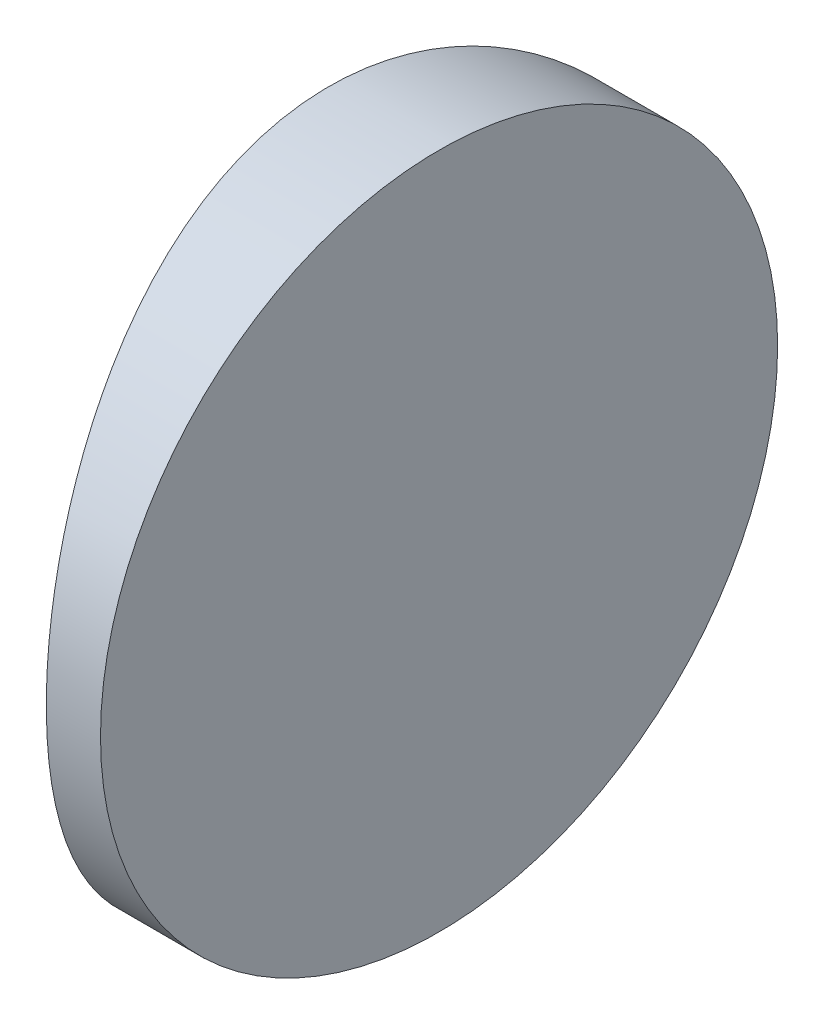
ISO-10303-21;
HEADER;
FILE_DESCRIPTION(('STEP AP214'),'2;1');
FILE_NAME('part.step','',(''),(''),'','','');
FILE_SCHEMA(('AUTOMOTIVE_DESIGN { 1 0 10303 214 1 1 1 1 }'));
ENDSEC;
DATA;
#1=APPLICATION_CONTEXT('core data for automotive mechanical design processes');
#2=APPLICATION_PROTOCOL_DEFINITION('international standard','automotive_design',2000,#1);
#3=PRODUCT_CONTEXT('',#1,'mechanical');
#4=PRODUCT('Part','Part','',(#3));
#5=PRODUCT_RELATED_PRODUCT_CATEGORY('part','',(#4));
#6=PRODUCT_DEFINITION_FORMATION('','',#4);
#7=PRODUCT_DEFINITION_CONTEXT('part definition',#1,'design');
#8=PRODUCT_DEFINITION('design','',#6,#7);
#9=PRODUCT_DEFINITION_SHAPE('','',#8);
#10=(LENGTH_UNIT() NAMED_UNIT(*) SI_UNIT(.MILLI.,.METRE.));
#11=(NAMED_UNIT(*) PLANE_ANGLE_UNIT() SI_UNIT($,.RADIAN.));
#12=(NAMED_UNIT(*) SI_UNIT($,.STERADIAN.) SOLID_ANGLE_UNIT());
#13=UNCERTAINTY_MEASURE_WITH_UNIT(LENGTH_MEASURE(1.E-05),#10,'distance_accuracy_value','');
#14=(GEOMETRIC_REPRESENTATION_CONTEXT(3) GLOBAL_UNCERTAINTY_ASSIGNED_CONTEXT((#13)) GLOBAL_UNIT_ASSIGNED_CONTEXT((#10,
#11,#12)) REPRESENTATION_CONTEXT('',''));
#15=CARTESIAN_POINT('',(0.,0.,0.));
#16=DIRECTION('',(0.,0.,1.));
#17=DIRECTION('',(1.,0.,0.));
#18=AXIS2_PLACEMENT_3D('',#15,#16,#17);
#19=CARTESIAN_POINT('',(4.35520433485127,25.,0.));
#20=DIRECTION('',(0.,-1.,0.));
#21=DIRECTION('',(0.,0.,-1.));
#22=AXIS2_PLACEMENT_3D('',#19,#20,#21);
#23=CYLINDRICAL_SURFACE('',#22,38.78);
#24=CARTESIAN_POINT('',(-34.4247956651487,0.,0.));
#25=CARTESIAN_POINT('',(-34.4248006243454,-6.96973027213713E-06,-0.341550953013682));
#26=CARTESIAN_POINT('',(-34.4202755844788,0.0140042663220976,-0.683020259382038));
#27=CARTESIAN_POINT('',(-34.4023100308665,0.0699044907652003,-1.36353713113696));
#28=CARTESIAN_POINT('',(-34.3888678677692,0.111798636509989,-1.70258423677357));
#29=CARTESIAN_POINT('',(-34.3534143550768,0.223130385841624,-2.37592943781657));
#30=CARTESIAN_POINT('',(-34.3313962516047,0.292589698855622,-2.71022357447478));
#31=CARTESIAN_POINT('',(-34.2793904765031,0.458417378829021,-3.37141619240535));
#32=CARTESIAN_POINT('',(-34.2494031363117,0.55478462670387,-3.69831498063466));
#33=CARTESIAN_POINT('',(-34.1823222768421,0.773391385006729,-4.34188087877066));
#34=CARTESIAN_POINT('',(-34.1452424086419,0.895581240950402,-4.65856629990092));
#35=CARTESIAN_POINT('',(-34.0649085252073,1.16495735031037,-5.28030236192717));
#36=CARTESIAN_POINT('',(-34.0216544558387,1.31214382289512,-5.58535290078066));
#37=CARTESIAN_POINT('',(-33.9300939776697,1.63036920075595,-6.18185867600442));
#38=CARTESIAN_POINT('',(-33.8817886750151,1.80140288656753,-6.47331686876776));
#39=CARTESIAN_POINT('',(-33.7813230452146,2.16621691652042,-7.04108224012345));
#40=CARTESIAN_POINT('',(-33.7291612355484,2.36000602532954,-7.3173835202391));
#41=CARTESIAN_POINT('',(-33.6207594846892,2.77494579582655,-7.86088898215571));
#42=CARTESIAN_POINT('',(-33.5644451566371,2.99672679945906,-8.12759723804377));
#43=CARTESIAN_POINT('',(-33.450610113212,3.46163657215415,-8.64165173650942));
#44=CARTESIAN_POINT('',(-33.3930888580666,3.70477505475633,-8.88898907130167));
#45=CARTESIAN_POINT('',(-33.2783816259764,4.21090158497327,-9.36274770477179));
#46=CARTESIAN_POINT('',(-33.2211957898369,4.47389740401412,-9.58916073654863));
#47=CARTESIAN_POINT('',(-33.1087642730309,5.01793250592284,-10.0194256602124));
#48=CARTESIAN_POINT('',(-33.0535177398293,5.29896370262685,-10.223287552773));
#49=CARTESIAN_POINT('',(-32.945005240198,5.88543180010284,-10.6124788758062));
#50=CARTESIAN_POINT('',(-32.8918353839636,6.19132708587796,-10.7971452966037));
#51=CARTESIAN_POINT('',(-32.7907746690252,6.8183587112528,-11.1398637368011));
#52=CARTESIAN_POINT('',(-32.7428817449185,7.1394890169221,-11.2979261819263));
#53=CARTESIAN_POINT('',(-32.6538958873889,7.79465474570324,-11.5860974668829));
#54=CARTESIAN_POINT('',(-32.6127971532625,8.12867885667799,-11.716230181011));
#55=CARTESIAN_POINT('',(-32.538699552233,8.80736023101136,-11.9475086271894));
#56=CARTESIAN_POINT('',(-32.5056986021252,9.15201473389929,-12.0486618155246));
#57=CARTESIAN_POINT('',(-32.4374931523346,9.98978889958507,-12.2557051107878));
#58=CARTESIAN_POINT('',(-32.4067308102467,10.4869209737582,-12.3471687576587));
#59=CARTESIAN_POINT('',(-32.3654847177115,11.4894290791569,-12.4693084502081));
#60=CARTESIAN_POINT('',(-32.3549993142723,11.9948044349964,-12.4999894509406));
#61=CARTESIAN_POINT('',(-32.3549844401088,12.8410331984954,-12.500007121162));
#62=CARTESIAN_POINT('',(-32.3597525451357,13.181984467207,-12.4860378710293));
#63=CARTESIAN_POINT('',(-32.3786592446169,13.8614505861886,-12.430309637383));
#64=CARTESIAN_POINT('',(-32.3927995909733,14.1999649689839,-12.388545458308));
#65=CARTESIAN_POINT('',(-32.4300242235516,14.8722186883792,-12.277571390077));
#66=CARTESIAN_POINT('',(-32.4531154651062,15.2059541018239,-12.2083401565393));
#67=CARTESIAN_POINT('',(-32.5075200020678,15.8660426190265,-12.0430692008971));
#68=CARTESIAN_POINT('',(-32.5388336327364,16.1923954211749,-11.9470283856431));
#69=CARTESIAN_POINT('',(-32.6086564645724,16.8347840748639,-11.7292126558898));
#70=CARTESIAN_POINT('',(-32.6471497023733,17.1508410218064,-11.607494755451));
#71=CARTESIAN_POINT('',(-32.7302533491094,17.7713686933367,-11.3391772117173));
#72=CARTESIAN_POINT('',(-32.7748638111108,18.0758393173852,-11.1925773525716));
#73=CARTESIAN_POINT('',(-32.8689371372268,18.6712832201667,-10.8756149632991));
#74=CARTESIAN_POINT('',(-32.9183991088287,18.9622589670459,-10.7052568014688));
#75=CARTESIAN_POINT('',(-33.0208561790664,19.529172721316,-10.3418634532768));
#76=CARTESIAN_POINT('',(-33.0738525537621,19.8051052314378,-10.1488200572657));
#77=CARTESIAN_POINT('',(-33.1837387905927,20.3490196369089,-9.73465601364268));
#78=CARTESIAN_POINT('',(-33.2406993289578,20.6164447969526,-9.51282265132234));
#79=CARTESIAN_POINT('',(-33.3553473667716,21.13194675963,-9.04765633755809));
#80=CARTESIAN_POINT('',(-33.4130351871656,21.3800146462109,-8.80431358756439));
#81=CARTESIAN_POINT('',(-33.5275782231792,21.8552133958703,-8.29762952616983));
#82=CARTESIAN_POINT('',(-33.5844331433876,22.0823369747831,-8.03428131476231));
#83=CARTESIAN_POINT('',(-33.6957445884539,22.5139795578783,-7.48939023467382));
#84=CARTESIAN_POINT('',(-33.7502021809569,22.718508686985,-7.20785560597706));
#85=CARTESIAN_POINT('',(-33.8566124753977,23.1085169903914,-6.62092153309067));
#86=CARTESIAN_POINT('',(-33.9084679372433,23.2933888279939,-6.31510034301634));
#87=CARTESIAN_POINT('',(-34.0066718220295,23.6365238949408,-5.68818787229466));
#88=CARTESIAN_POINT('',(-34.0530223985287,23.7947975398496,-5.36710263236903));
#89=CARTESIAN_POINT('',(-34.138876484735,24.0833865433725,-4.7120190155656));
#90=CARTESIAN_POINT('',(-34.1783855970904,24.2137247999806,-4.37803148150949));
#91=CARTESIAN_POINT('',(-34.2494445083653,24.4454020087358,-3.69945071450148));
#92=CARTESIAN_POINT('',(-34.2809963036901,24.5467482355303,-3.35486016612333));
#93=CARTESIAN_POINT('',(-34.3462083288709,24.7545704212906,-2.51600079585698));
#94=CARTESIAN_POINT('',(-34.3755357371718,24.846463013107,-2.01769700838065));
#95=CARTESIAN_POINT('',(-34.4148250854708,24.9691706054679,-1.01286863459891));
#96=CARTESIAN_POINT('',(-34.4247883132077,24.9999896674706,-0.506344597208032));
#97=CARTESIAN_POINT('',(-34.4248006243454,25.0000069697303,0.341550953013701));
#98=CARTESIAN_POINT('',(-34.4202755844788,24.9859957336779,0.683020259382056));
#99=CARTESIAN_POINT('',(-34.4023100308665,24.9300955092348,1.36353713113698));
#100=CARTESIAN_POINT('',(-34.3888678677692,24.88820136349,1.70258423677359));
#101=CARTESIAN_POINT('',(-34.3534143550768,24.7768696141584,2.37592943781659));
#102=CARTESIAN_POINT('',(-34.3313962516047,24.7074103011444,2.7102235744748));
#103=CARTESIAN_POINT('',(-34.2793904765031,24.541582621171,3.37141619240538));
#104=CARTESIAN_POINT('',(-34.2494031363117,24.4452153732961,3.69831498063468));
#105=CARTESIAN_POINT('',(-34.1823222768421,24.2266086149933,4.34188087877068));
#106=CARTESIAN_POINT('',(-34.1452424086419,24.1044187590496,4.65856629990094));
#107=CARTESIAN_POINT('',(-34.0649085252073,23.8350426496896,5.28030236192719));
#108=CARTESIAN_POINT('',(-34.0216544558387,23.6878561771049,5.58535290078068));
#109=CARTESIAN_POINT('',(-33.9300939776697,23.3696307992441,6.18185867600444));
#110=CARTESIAN_POINT('',(-33.8817886750151,23.1985971134325,6.47331686876778));
#111=CARTESIAN_POINT('',(-33.7813230452146,22.8337830834796,7.04108224012347));
#112=CARTESIAN_POINT('',(-33.7291612355484,22.6399939746705,7.31738352023912));
#113=CARTESIAN_POINT('',(-33.6207594846892,22.2250542041734,7.86088898215572));
#114=CARTESIAN_POINT('',(-33.5644451566371,22.0032732005409,8.12759723804379));
#115=CARTESIAN_POINT('',(-33.450610113212,21.5383634278459,8.64165173650944));
#116=CARTESIAN_POINT('',(-33.3930888580666,21.2952249452437,8.88898907130168));
#117=CARTESIAN_POINT('',(-33.2783816259764,20.7890984150267,9.36274770477181));
#118=CARTESIAN_POINT('',(-33.2211957898369,20.5261025959859,9.58916073654864));
#119=CARTESIAN_POINT('',(-33.1087642730309,19.9820674940772,10.0194256602124));
#120=CARTESIAN_POINT('',(-33.0535177398293,19.7010362973732,10.223287552773));
#121=CARTESIAN_POINT('',(-32.945005240198,19.1145681998972,10.6124788758062));
#122=CARTESIAN_POINT('',(-32.8918353839636,18.808672914122,10.7971452966038));
#123=CARTESIAN_POINT('',(-32.7907746690252,18.1816412887472,11.1398637368011));
#124=CARTESIAN_POINT('',(-32.7428817449185,17.8605109830779,11.2979261819263));
#125=CARTESIAN_POINT('',(-32.6538958873889,17.2053452542968,11.5860974668829));
#126=CARTESIAN_POINT('',(-32.6127971532625,16.871321143322,11.716230181011));
#127=CARTESIAN_POINT('',(-32.538699552233,16.1926397689886,11.9475086271894));
#128=CARTESIAN_POINT('',(-32.5056986021252,15.8479852661007,12.0486618155246));
#129=CARTESIAN_POINT('',(-32.4374931523346,15.0102111004149,12.2557051107878));
#130=CARTESIAN_POINT('',(-32.4067308102466,14.5130790262418,12.3471687576587));
#131=CARTESIAN_POINT('',(-32.3654847177114,13.5105709208431,12.4693084502081));
#132=CARTESIAN_POINT('',(-32.3549993142723,13.0051955650036,12.4999894509406));
#133=CARTESIAN_POINT('',(-32.3549844401088,12.1589668015046,12.500007121162));
#134=CARTESIAN_POINT('',(-32.3597525451357,11.818015532793,12.4860378710294));
#135=CARTESIAN_POINT('',(-32.3786592446169,11.1385494138114,12.430309637383));
#136=CARTESIAN_POINT('',(-32.3927995909733,10.8000350310161,12.3885454583081));
#137=CARTESIAN_POINT('',(-32.4300242235516,10.1277813116208,12.2775713900771));
#138=CARTESIAN_POINT('',(-32.4531154651062,9.79404589817613,12.2083401565393));
#139=CARTESIAN_POINT('',(-32.5075200020678,9.13395738097351,12.0430692008971));
#140=CARTESIAN_POINT('',(-32.5388336327364,8.80760457882512,11.9470283856431));
#141=CARTESIAN_POINT('',(-32.6086564645724,8.16521592513612,11.7292126558899));
#142=CARTESIAN_POINT('',(-32.6471497023733,7.8491589781936,11.6074947554511));
#143=CARTESIAN_POINT('',(-32.7302533491094,7.22863130666328,11.3391772117173));
#144=CARTESIAN_POINT('',(-32.7748638111108,6.92416068261477,11.1925773525716));
#145=CARTESIAN_POINT('',(-32.8689371372268,6.32871677983329,10.8756149632992));
#146=CARTESIAN_POINT('',(-32.9183991088287,6.03774103295415,10.7052568014689));
#147=CARTESIAN_POINT('',(-33.0208561790664,5.47082727868405,10.3418634532768));
#148=CARTESIAN_POINT('',(-33.0738525537621,5.19489476856219,10.1488200572657));
#149=CARTESIAN_POINT('',(-33.1837387905926,4.65098036309112,9.7346560136427));
#150=CARTESIAN_POINT('',(-33.2406993289577,4.38355520304743,9.51282265132236));
#151=CARTESIAN_POINT('',(-33.3553473667716,3.86805324037001,9.04765633755811));
#152=CARTESIAN_POINT('',(-33.4130351871655,3.61998535378906,8.80431358756441));
#153=CARTESIAN_POINT('',(-33.5275782231792,3.14478660412967,8.29762952616986));
#154=CARTESIAN_POINT('',(-33.5844331433876,2.91766302521691,8.03428131476234));
#155=CARTESIAN_POINT('',(-33.6957445884539,2.48602044212169,7.48939023467385));
#156=CARTESIAN_POINT('',(-33.7502021809569,2.28149131301501,7.20785560597709));
#157=CARTESIAN_POINT('',(-33.8566124753977,1.89148300960865,6.62092153309069));
#158=CARTESIAN_POINT('',(-33.9084679372433,1.70661117200615,6.31510034301637));
#159=CARTESIAN_POINT('',(-34.0066718220295,1.36347610505925,5.68818787229469));
#160=CARTESIAN_POINT('',(-34.0530223985287,1.20520246015039,5.36710263236906));
#161=CARTESIAN_POINT('',(-34.138876484735,0.916613456627479,4.71201901556563));
#162=CARTESIAN_POINT('',(-34.1783855970904,0.786275200019367,4.37803148150953));
#163=CARTESIAN_POINT('',(-34.2494445083653,0.554597991264161,3.69945071450151));
#164=CARTESIAN_POINT('',(-34.2809963036901,0.453251764469754,3.35486016612336));
#165=CARTESIAN_POINT('',(-34.3462083288709,0.245429578709397,2.516000795857));
#166=CARTESIAN_POINT('',(-34.3755357371718,0.153536986892969,2.01769700838067));
#167=CARTESIAN_POINT('',(-34.4148250854708,0.0308293945321124,1.01286863459893));
#168=CARTESIAN_POINT('',(-34.4247883132077,1.03325293978608E-05,0.506344597208053));
#169=CARTESIAN_POINT('',(-34.4247956651487,0.,0.));
#170=B_SPLINE_CURVE_WITH_KNOTS('',3,(#24,#25,#26,#27,#28,#29,#30,#31,#32,#33,#34,#35,#36,#37,
#38,#39,#40,#41,#42,#43,#44,#45,#46,#47,#48,#49,#50,#51,#52,#53,#54,#55,#56,#57,#58,#59,#60,#61,
#62,#63,#64,#65,#66,#67,#68,#69,#70,#71,#72,#73,#74,#75,#76,#77,#78,#79,#80,#81,#82,#83,#84,#85,
#86,#87,#88,#89,#90,#91,#92,#93,#94,#95,#96,#97,#98,#99,#100,#101,#102,#103,#104,#105,#106,#107,
#108,#109,#110,#111,#112,#113,#114,#115,#116,#117,#118,#119,#120,#121,#122,#123,#124,#125,#126,
#127,#128,#129,#130,#131,#132,#133,#134,#135,#136,#137,#138,#139,#140,#141,#142,#143,#144,#145,
#146,#147,#148,#149,#150,#151,#152,#153,#154,#155,#156,#157,#158,#159,#160,#161,#162,#163,#164,
#165,#166,#167,#168,#169),.UNSPECIFIED.,.T.,.F.,(4,2,2,2,2,2,2,2,2,2,2,2,2,2,2,2,2,2,2,2,2,2,2,
2,2,2,2,2,2,2,2,2,2,2,2,2,2,2,2,2,2,2,2,2,2,2,2,2,2,2,2,2,2,2,2,2,2,2,2,2,2,2,2,2,2,2,2,2,2,2,2,
2,4),(0.,1.0241958474949,2.04858118773537,3.07377490665391,4.09892599474183,5.12212346266154,
6.14532990236245,7.16831274232368,8.1916909033493,9.24473646655151,10.2982634672713,
11.3522049381706,12.4056771316364,13.4880913445008,14.5700803817525,15.6511408197881,
16.7319228561384,18.2469526030111,19.7618588382652,20.7844990881369,21.8073305485318,
22.8309584030581,23.8546280016811,24.8760481021873,25.8974770639545,26.9187184687033,
27.9403305993561,28.9954161412386,30.0509848266204,31.1069192517225,32.1623785601615,
33.2443416843809,34.3258801312714,35.406528646651,36.4869057686127,38.0053630293972,
39.5237193076804,40.5479151551753,41.5723004954158,42.5974942143343,43.6226453024223,
44.645842770342,45.6690492100429,46.6920320500041,47.7154102110297,48.7684557742319,
49.8219827749517,50.875924245851,51.9293964393168,53.0118106521812,54.0937996894329,
55.1748601274685,56.2556421638189,57.7706719106915,59.2855781459456,60.3082183958173,
61.3310498562122,62.3546777107385,63.3783473093616,64.3997674098678,65.4211963716349,
66.4424377763837,67.4640499070365,68.519135448919,69.5747041343009,70.630638559403,
71.6860978678419,72.7680609920613,73.8495994389518,74.9302479543314,76.0106250762931,
77.5290823370776,79.0474386153608),.UNSPECIFIED.);
#171=CARTESIAN_POINT('',(-34.4247956651487,0.,0.));
#172=VERTEX_POINT('',#171);
#173=EDGE_CURVE('E10',#172,#172,#170,.T.);
#174=ORIENTED_EDGE('',*,*,#173,.F.);
#175=EDGE_LOOP('',(#174));
#176=FACE_BOUND('',#175,.T.);
#177=ADVANCED_FACE('F35',(#176),#23,.T.);
#178=CARTESIAN_POINT('',(-30.3547956651487,25.,-12.5));
#179=DIRECTION('',(1.,0.,0.));
#180=DIRECTION('',(0.,0.,-1.));
#181=AXIS2_PLACEMENT_3D('',#178,#179,#180);
#182=PLANE('',#181);
#183=CARTESIAN_POINT('',(-30.3547956651487,12.5,0.));
#184=DIRECTION('',(1.,0.,0.));
#185=DIRECTION('',(0.,0.,-1.));
#186=AXIS2_PLACEMENT_3D('',#183,#184,#185);
#187=CIRCLE('',#186,12.5);
#188=CARTESIAN_POINT('',(-30.3547956651487,12.5,-12.5));
#189=VERTEX_POINT('',#188);
#190=EDGE_CURVE('E45',#189,#189,#187,.T.);
#191=ORIENTED_EDGE('',*,*,#190,.T.);
#192=EDGE_LOOP('',(#191));
#193=FACE_BOUND('',#192,.T.);
#194=ADVANCED_FACE('F37',(#193),#182,.T.);
#195=CARTESIAN_POINT('',(-43.0547956651487,12.5,0.));
#196=DIRECTION('',(1.,0.,0.));
#197=DIRECTION('',(0.,0.,-1.));
#198=AXIS2_PLACEMENT_3D('',#195,#196,#197);
#199=CYLINDRICAL_SURFACE('',#198,12.5);
#200=ORIENTED_EDGE('',*,*,#190,.F.);
#201=EDGE_LOOP('',(#200));
#202=FACE_BOUND('',#201,.T.);
#203=ORIENTED_EDGE('',*,*,#173,.T.);
#204=EDGE_LOOP('',(#203));
#205=FACE_BOUND('',#204,.T.);
#206=ADVANCED_FACE('F52',(#202,#205),#199,.T.);
#207=CLOSED_SHELL('',(#177,#194,#206));
#208=MANIFOLD_SOLID_BREP('B2',#207);
#209=ADVANCED_BREP_SHAPE_REPRESENTATION('',(#18,#208),#14);
#210=SHAPE_DEFINITION_REPRESENTATION(#9,#209);
ENDSEC;
END-ISO-10303-21;
